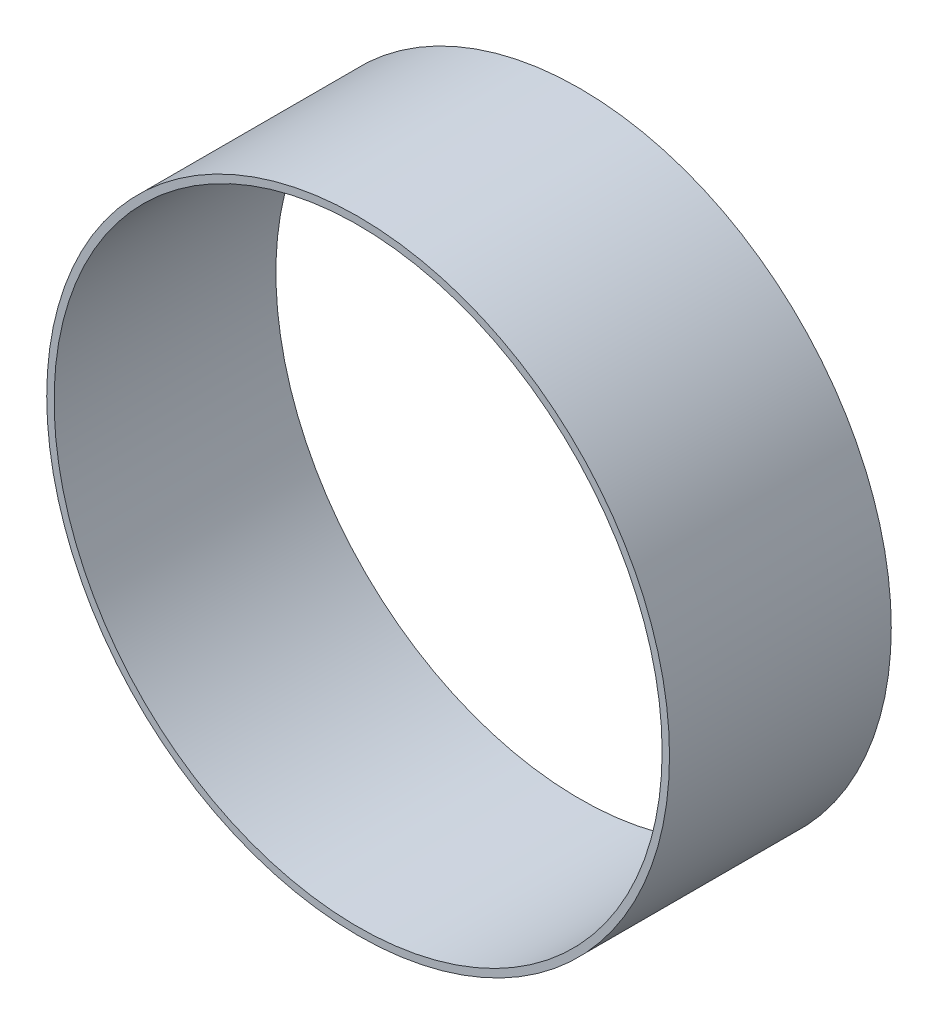
ISO-10303-21;
HEADER;
FILE_DESCRIPTION(('STEP AP214'),'2;1');
FILE_NAME('part.step','',(''),(''),'','','');
FILE_SCHEMA(('AUTOMOTIVE_DESIGN { 1 0 10303 214 1 1 1 1 }'));
ENDSEC;
DATA;
#1=APPLICATION_CONTEXT('core data for automotive mechanical design processes');
#2=APPLICATION_PROTOCOL_DEFINITION('international standard','automotive_design',2000,#1);
#3=PRODUCT_CONTEXT('',#1,'mechanical');
#4=PRODUCT('Part','Part','',(#3));
#5=PRODUCT_RELATED_PRODUCT_CATEGORY('part','',(#4));
#6=PRODUCT_DEFINITION_FORMATION('','',#4);
#7=PRODUCT_DEFINITION_CONTEXT('part definition',#1,'design');
#8=PRODUCT_DEFINITION('design','',#6,#7);
#9=PRODUCT_DEFINITION_SHAPE('','',#8);
#10=(LENGTH_UNIT() NAMED_UNIT(*) SI_UNIT(.MILLI.,.METRE.));
#11=(NAMED_UNIT(*) PLANE_ANGLE_UNIT() SI_UNIT($,.RADIAN.));
#12=(NAMED_UNIT(*) SI_UNIT($,.STERADIAN.) SOLID_ANGLE_UNIT());
#13=UNCERTAINTY_MEASURE_WITH_UNIT(LENGTH_MEASURE(1.E-05),#10,'distance_accuracy_value','');
#14=(GEOMETRIC_REPRESENTATION_CONTEXT(3) GLOBAL_UNCERTAINTY_ASSIGNED_CONTEXT((#13)) GLOBAL_UNIT_ASSIGNED_CONTEXT((#10,
#11,#12)) REPRESENTATION_CONTEXT('',''));
#15=CARTESIAN_POINT('',(0.,0.,0.));
#16=DIRECTION('',(0.,0.,1.));
#17=DIRECTION('',(1.,0.,0.));
#18=AXIS2_PLACEMENT_3D('',#15,#16,#17);
#19=CARTESIAN_POINT('',(0.,0.,6.));
#20=DIRECTION('',(0.,0.,1.));
#21=DIRECTION('',(1.,0.,0.));
#22=AXIS2_PLACEMENT_3D('',#19,#20,#21);
#23=PLANE('',#22);
#24=CARTESIAN_POINT('',(0.,0.,6.));
#25=DIRECTION('',(0.,0.,1.));
#26=DIRECTION('',(1.,0.,0.));
#27=AXIS2_PLACEMENT_3D('',#24,#25,#26);
#28=CIRCLE('',#27,8.425);
#29=CARTESIAN_POINT('',(8.425,0.,6.));
#30=VERTEX_POINT('',#29);
#31=EDGE_CURVE('E10',#30,#30,#28,.T.);
#32=ORIENTED_EDGE('',*,*,#31,.T.);
#33=EDGE_LOOP('',(#32));
#34=FACE_BOUND('',#33,.T.);
#35=CARTESIAN_POINT('',(0.,0.,6.));
#36=DIRECTION('',(0.,0.,1.));
#37=DIRECTION('',(1.,0.,0.));
#38=AXIS2_PLACEMENT_3D('',#35,#36,#37);
#39=CIRCLE('',#38,8.225);
#40=CARTESIAN_POINT('',(8.225,0.,6.));
#41=VERTEX_POINT('',#40);
#42=EDGE_CURVE('E42',#41,#41,#39,.T.);
#43=ORIENTED_EDGE('',*,*,#42,.F.);
#44=EDGE_LOOP('',(#43));
#45=FACE_BOUND('',#44,.T.);
#46=ADVANCED_FACE('F31',(#34,#45),#23,.T.);
#47=CARTESIAN_POINT('',(0.,0.,0.));
#48=DIRECTION('',(0.,0.,1.));
#49=DIRECTION('',(1.,0.,0.));
#50=AXIS2_PLACEMENT_3D('',#47,#48,#49);
#51=PLANE('',#50);
#52=CARTESIAN_POINT('',(0.,0.,0.));
#53=DIRECTION('',(0.,0.,1.));
#54=DIRECTION('',(1.,0.,0.));
#55=AXIS2_PLACEMENT_3D('',#52,#53,#54);
#56=CIRCLE('',#55,8.425);
#57=CARTESIAN_POINT('',(8.425,0.,0.));
#58=VERTEX_POINT('',#57);
#59=EDGE_CURVE('E35',#58,#58,#56,.T.);
#60=ORIENTED_EDGE('',*,*,#59,.F.);
#61=EDGE_LOOP('',(#60));
#62=FACE_BOUND('',#61,.T.);
#63=CARTESIAN_POINT('',(0.,0.,0.));
#64=DIRECTION('',(0.,0.,1.));
#65=DIRECTION('',(1.,0.,0.));
#66=AXIS2_PLACEMENT_3D('',#63,#64,#65);
#67=CIRCLE('',#66,8.225);
#68=CARTESIAN_POINT('',(8.225,0.,0.));
#69=VERTEX_POINT('',#68);
#70=EDGE_CURVE('E44',#69,#69,#67,.T.);
#71=ORIENTED_EDGE('',*,*,#70,.T.);
#72=EDGE_LOOP('',(#71));
#73=FACE_BOUND('',#72,.T.);
#74=ADVANCED_FACE('F54',(#62,#73),#51,.F.);
#75=CARTESIAN_POINT('',(0.,0.,6.));
#76=DIRECTION('',(0.,0.,-1.));
#77=DIRECTION('',(-1.,0.,0.));
#78=AXIS2_PLACEMENT_3D('',#75,#76,#77);
#79=CYLINDRICAL_SURFACE('',#78,8.425);
#80=ORIENTED_EDGE('',*,*,#31,.F.);
#81=EDGE_LOOP('',(#80));
#82=FACE_BOUND('',#81,.T.);
#83=ORIENTED_EDGE('',*,*,#59,.T.);
#84=EDGE_LOOP('',(#83));
#85=FACE_BOUND('',#84,.T.);
#86=ADVANCED_FACE('F33',(#82,#85),#79,.T.);
#87=CARTESIAN_POINT('',(0.,0.,6.));
#88=DIRECTION('',(0.,0.,-1.));
#89=DIRECTION('',(-1.,0.,0.));
#90=AXIS2_PLACEMENT_3D('',#87,#88,#89);
#91=CYLINDRICAL_SURFACE('',#90,8.225);
#92=ORIENTED_EDGE('',*,*,#42,.T.);
#93=EDGE_LOOP('',(#92));
#94=FACE_BOUND('',#93,.T.);
#95=ORIENTED_EDGE('',*,*,#70,.F.);
#96=EDGE_LOOP('',(#95));
#97=FACE_BOUND('',#96,.T.);
#98=ADVANCED_FACE('F50',(#94,#97),#91,.F.);
#99=CLOSED_SHELL('',(#46,#74,#86,#98));
#100=MANIFOLD_SOLID_BREP('B2',#99);
#101=ADVANCED_BREP_SHAPE_REPRESENTATION('',(#18,#100),#14);
#102=SHAPE_DEFINITION_REPRESENTATION(#9,#101);
ENDSEC;
END-ISO-10303-21;
